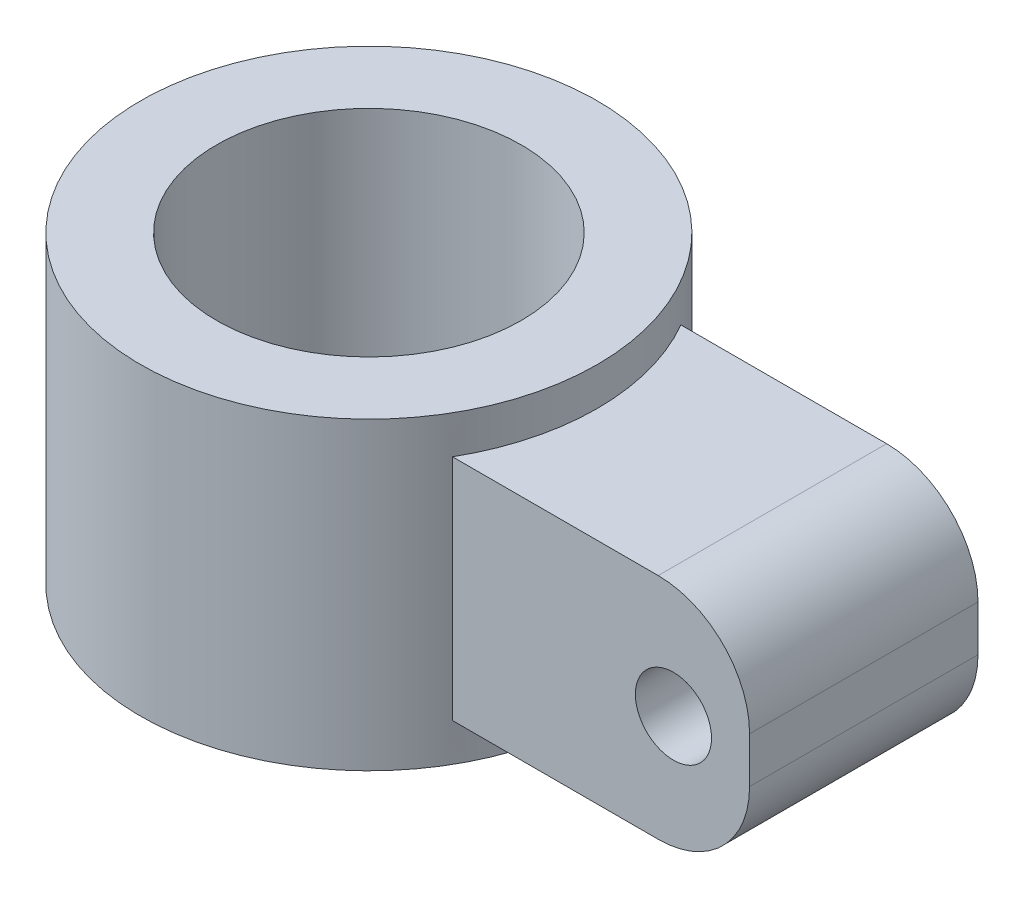
ISO-10303-21;
HEADER;
FILE_DESCRIPTION(('STEP AP214'),'2;1');
FILE_NAME('part.step','',(''),(''),'','','');
FILE_SCHEMA(('AUTOMOTIVE_DESIGN { 1 0 10303 214 1 1 1 1 }'));
ENDSEC;
DATA;
#1=APPLICATION_CONTEXT('core data for automotive mechanical design processes');
#2=APPLICATION_PROTOCOL_DEFINITION('international standard','automotive_design',2000,#1);
#3=PRODUCT_CONTEXT('',#1,'mechanical');
#4=PRODUCT('Part','Part','',(#3));
#5=PRODUCT_RELATED_PRODUCT_CATEGORY('part','',(#4));
#6=PRODUCT_DEFINITION_FORMATION('','',#4);
#7=PRODUCT_DEFINITION_CONTEXT('part definition',#1,'design');
#8=PRODUCT_DEFINITION('design','',#6,#7);
#9=PRODUCT_DEFINITION_SHAPE('','',#8);
#10=(LENGTH_UNIT() NAMED_UNIT(*) SI_UNIT(.MILLI.,.METRE.));
#11=(NAMED_UNIT(*) PLANE_ANGLE_UNIT() SI_UNIT($,.RADIAN.));
#12=(NAMED_UNIT(*) SI_UNIT($,.STERADIAN.) SOLID_ANGLE_UNIT());
#13=UNCERTAINTY_MEASURE_WITH_UNIT(LENGTH_MEASURE(1.E-05),#10,'distance_accuracy_value','');
#14=(GEOMETRIC_REPRESENTATION_CONTEXT(3) GLOBAL_UNCERTAINTY_ASSIGNED_CONTEXT((#13)) GLOBAL_UNIT_ASSIGNED_CONTEXT((#10,
#11,#12)) REPRESENTATION_CONTEXT('',''));
#15=CARTESIAN_POINT('',(0.,0.,0.));
#16=DIRECTION('',(0.,0.,1.));
#17=DIRECTION('',(1.,0.,0.));
#18=AXIS2_PLACEMENT_3D('',#15,#16,#17);
#19=CARTESIAN_POINT('',(0.,-10.,0.));
#20=DIRECTION('',(0.,1.,0.));
#21=DIRECTION('',(-1.,0.,0.));
#22=AXIS2_PLACEMENT_3D('',#19,#20,#21);
#23=CYLINDRICAL_SURFACE('',#22,7.5);
#24=CARTESIAN_POINT('',(0.,0.,0.));
#25=DIRECTION('',(0.,-1.,0.));
#26=DIRECTION('',(1.,0.,0.));
#27=AXIS2_PLACEMENT_3D('',#24,#25,#26);
#28=CIRCLE('',#27,7.5);
#29=CARTESIAN_POINT('',(7.5,0.,0.));
#30=VERTEX_POINT('',#29);
#31=EDGE_CURVE('E11',#30,#30,#28,.T.);
#32=ORIENTED_EDGE('',*,*,#31,.T.);
#33=EDGE_LOOP('',(#32));
#34=FACE_BOUND('',#33,.T.);
#35=CARTESIAN_POINT('',(0.,-10.,0.));
#36=DIRECTION('',(0.,-1.,0.));
#37=DIRECTION('',(1.,0.,0.));
#38=AXIS2_PLACEMENT_3D('',#35,#36,#37);
#39=CIRCLE('',#38,7.5);
#40=CARTESIAN_POINT('',(7.5,-10.,0.));
#41=VERTEX_POINT('',#40);
#42=EDGE_CURVE('E25',#41,#41,#39,.T.);
#43=ORIENTED_EDGE('',*,*,#42,.F.);
#44=EDGE_LOOP('',(#43));
#45=FACE_BOUND('',#44,.T.);
#46=CARTESIAN_POINT('',(0.,-1.25,0.));
#47=DIRECTION('',(0.,-1.,0.));
#48=DIRECTION('',(1.,0.,0.));
#49=AXIS2_PLACEMENT_3D('',#46,#47,#48);
#50=CIRCLE('',#49,7.5);
#51=CARTESIAN_POINT('',(6.49519052838329,-1.25,-3.75));
#52=VERTEX_POINT('',#51);
#53=CARTESIAN_POINT('',(6.49519052838329,-1.25,3.75));
#54=VERTEX_POINT('',#53);
#55=EDGE_CURVE('E36',#52,#54,#50,.T.);
#56=ORIENTED_EDGE('',*,*,#55,.F.);
#57=DIRECTION('',(0.,1.,0.));
#58=VECTOR('',#57,1.);
#59=CARTESIAN_POINT('',(6.49519052838329,-10.,-3.75));
#60=LINE('',#59,#58);
#61=CARTESIAN_POINT('',(6.49519052838329,-8.75,-3.75));
#62=VERTEX_POINT('',#61);
#63=EDGE_CURVE('E42',#62,#52,#60,.T.);
#64=ORIENTED_EDGE('',*,*,#63,.F.);
#65=CARTESIAN_POINT('',(0.,-8.75,0.));
#66=DIRECTION('',(0.,1.,0.));
#67=DIRECTION('',(-1.,0.,0.));
#68=AXIS2_PLACEMENT_3D('',#65,#66,#67);
#69=CIRCLE('',#68,7.5);
#70=CARTESIAN_POINT('',(6.49519052838329,-8.75,3.75));
#71=VERTEX_POINT('',#70);
#72=EDGE_CURVE('E167',#71,#62,#69,.T.);
#73=ORIENTED_EDGE('',*,*,#72,.F.);
#74=DIRECTION('',(0.,1.,0.));
#75=VECTOR('',#74,1.);
#76=CARTESIAN_POINT('',(6.49519052838329,-10.,3.75));
#77=LINE('',#76,#75);
#78=EDGE_CURVE('E163',#54,#71,#77,.F.);
#79=ORIENTED_EDGE('',*,*,#78,.F.);
#80=EDGE_LOOP('',(#56,#64,#73,#79));
#81=FACE_BOUND('',#80,.T.);
#82=ADVANCED_FACE('F17',(#34,#45,#81),#23,.T.);
#83=CARTESIAN_POINT('',(0.,-10.,0.));
#84=DIRECTION('',(0.,-1.,0.));
#85=DIRECTION('',(1.,0.,0.));
#86=AXIS2_PLACEMENT_3D('',#83,#84,#85);
#87=PLANE('',#86);
#88=ORIENTED_EDGE('',*,*,#42,.T.);
#89=EDGE_LOOP('',(#88));
#90=FACE_BOUND('',#89,.T.);
#91=CARTESIAN_POINT('',(0.,-10.,0.));
#92=DIRECTION('',(0.,-1.,0.));
#93=DIRECTION('',(1.,0.,0.));
#94=AXIS2_PLACEMENT_3D('',#91,#92,#93);
#95=CIRCLE('',#94,5.);
#96=CARTESIAN_POINT('',(5.,-10.,0.));
#97=VERTEX_POINT('',#96);
#98=EDGE_CURVE('E159',#97,#97,#95,.T.);
#99=ORIENTED_EDGE('',*,*,#98,.F.);
#100=EDGE_LOOP('',(#99));
#101=FACE_BOUND('',#100,.T.);
#102=ADVANCED_FACE('F179',(#90,#101),#87,.T.);
#103=CARTESIAN_POINT('',(0.,0.,0.));
#104=DIRECTION('',(0.,-1.,0.));
#105=DIRECTION('',(1.,0.,0.));
#106=AXIS2_PLACEMENT_3D('',#103,#104,#105);
#107=PLANE('',#106);
#108=ORIENTED_EDGE('',*,*,#31,.F.);
#109=EDGE_LOOP('',(#108));
#110=FACE_BOUND('',#109,.T.);
#111=CARTESIAN_POINT('',(0.,0.,0.));
#112=DIRECTION('',(0.,-1.,0.));
#113=DIRECTION('',(1.,0.,0.));
#114=AXIS2_PLACEMENT_3D('',#111,#112,#113);
#115=CIRCLE('',#114,5.);
#116=CARTESIAN_POINT('',(5.,0.,0.));
#117=VERTEX_POINT('',#116);
#118=EDGE_CURVE('E155',#117,#117,#115,.T.);
#119=ORIENTED_EDGE('',*,*,#118,.T.);
#120=EDGE_LOOP('',(#119));
#121=FACE_BOUND('',#120,.T.);
#122=ADVANCED_FACE('F188',(#110,#121),#107,.F.);
#123=CARTESIAN_POINT('',(0.,-10.,0.));
#124=DIRECTION('',(0.,1.,0.));
#125=DIRECTION('',(-1.,0.,0.));
#126=AXIS2_PLACEMENT_3D('',#123,#124,#125);
#127=CYLINDRICAL_SURFACE('',#126,5.);
#128=ORIENTED_EDGE('',*,*,#98,.T.);
#129=EDGE_LOOP('',(#128));
#130=FACE_BOUND('',#129,.T.);
#131=ORIENTED_EDGE('',*,*,#118,.F.);
#132=EDGE_LOOP('',(#131));
#133=FACE_BOUND('',#132,.T.);
#134=ADVANCED_FACE('F193',(#130,#133),#127,.F.);
#135=CARTESIAN_POINT('',(16.25,-8.75,3.75));
#136=DIRECTION('',(0.,0.,-1.));
#137=DIRECTION('',(0.,1.,0.));
#138=AXIS2_PLACEMENT_3D('',#135,#136,#137);
#139=PLANE('',#138);
#140=CARTESIAN_POINT('',(13.75,-5.,3.75));
#141=DIRECTION('',(0.,0.,-1.));
#142=DIRECTION('',(0.,1.,0.));
#143=AXIS2_PLACEMENT_3D('',#140,#141,#142);
#144=CIRCLE('',#143,1.25);
#145=CARTESIAN_POINT('',(13.75,-3.75,3.75));
#146=VERTEX_POINT('',#145);
#147=EDGE_CURVE('E151',#146,#146,#144,.T.);
#148=ORIENTED_EDGE('',*,*,#147,.T.);
#149=EDGE_LOOP('',(#148));
#150=FACE_BOUND('',#149,.T.);
#151=DIRECTION('',(-1.,0.,0.));
#152=VECTOR('',#151,1.);
#153=CARTESIAN_POINT('',(16.25,-8.75,3.75));
#154=LINE('',#153,#152);
#155=CARTESIAN_POINT('',(13.25,-8.75,3.75));
#156=VERTEX_POINT('',#155);
#157=EDGE_CURVE('E147',#156,#71,#154,.T.);
#158=ORIENTED_EDGE('',*,*,#157,.F.);
#159=CARTESIAN_POINT('',(13.25,-5.75,3.75));
#160=DIRECTION('',(0.,0.,-1.));
#161=DIRECTION('',(0.,1.,0.));
#162=AXIS2_PLACEMENT_3D('',#159,#160,#161);
#163=CIRCLE('',#162,3.);
#164=CARTESIAN_POINT('',(16.25,-5.75,3.75));
#165=VERTEX_POINT('',#164);
#166=EDGE_CURVE('E144',#156,#165,#163,.F.);
#167=ORIENTED_EDGE('',*,*,#166,.T.);
#168=DIRECTION('',(0.,-1.,0.));
#169=VECTOR('',#168,1.);
#170=CARTESIAN_POINT('',(16.25,-8.75,3.75));
#171=LINE('',#170,#169);
#172=CARTESIAN_POINT('',(16.25,-4.25,3.75));
#173=VERTEX_POINT('',#172);
#174=EDGE_CURVE('E141',#173,#165,#171,.T.);
#175=ORIENTED_EDGE('',*,*,#174,.F.);
#176=CARTESIAN_POINT('',(13.25,-4.25,3.75));
#177=DIRECTION('',(0.,0.,-1.));
#178=DIRECTION('',(0.,1.,0.));
#179=AXIS2_PLACEMENT_3D('',#176,#177,#178);
#180=CIRCLE('',#179,3.);
#181=CARTESIAN_POINT('',(13.25,-1.25,3.75));
#182=VERTEX_POINT('',#181);
#183=EDGE_CURVE('E111',#173,#182,#180,.F.);
#184=ORIENTED_EDGE('',*,*,#183,.T.);
#185=DIRECTION('',(-1.,0.,0.));
#186=VECTOR('',#185,1.);
#187=CARTESIAN_POINT('',(16.25,-1.25,3.75));
#188=LINE('',#187,#186);
#189=EDGE_CURVE('E135',#182,#54,#188,.T.);
#190=ORIENTED_EDGE('',*,*,#189,.T.);
#191=ORIENTED_EDGE('',*,*,#78,.T.);
#192=EDGE_LOOP('',(#158,#167,#175,#184,#190,#191));
#193=FACE_BOUND('',#192,.T.);
#194=ADVANCED_FACE('F198',(#150,#193),#139,.F.);
#195=CARTESIAN_POINT('',(16.25,-8.75,-3.75));
#196=DIRECTION('',(0.,0.,1.));
#197=DIRECTION('',(0.,-1.,0.));
#198=AXIS2_PLACEMENT_3D('',#195,#196,#197);
#199=PLANE('',#198);
#200=CARTESIAN_POINT('',(13.75,-5.,-3.75));
#201=DIRECTION('',(0.,0.,1.));
#202=DIRECTION('',(0.,-1.,0.));
#203=AXIS2_PLACEMENT_3D('',#200,#201,#202);
#204=CIRCLE('',#203,1.25);
#205=CARTESIAN_POINT('',(13.75,-6.25,-3.75));
#206=VERTEX_POINT('',#205);
#207=EDGE_CURVE('E107',#206,#206,#204,.T.);
#208=ORIENTED_EDGE('',*,*,#207,.T.);
#209=EDGE_LOOP('',(#208));
#210=FACE_BOUND('',#209,.T.);
#211=DIRECTION('',(0.,1.,0.));
#212=VECTOR('',#211,1.);
#213=CARTESIAN_POINT('',(16.25,-8.75,-3.75));
#214=LINE('',#213,#212);
#215=CARTESIAN_POINT('',(16.25,-5.75,-3.75));
#216=VERTEX_POINT('',#215);
#217=CARTESIAN_POINT('',(16.25,-4.25,-3.75));
#218=VERTEX_POINT('',#217);
#219=EDGE_CURVE('E86',#216,#218,#214,.T.);
#220=ORIENTED_EDGE('',*,*,#219,.F.);
#221=CARTESIAN_POINT('',(13.25,-5.75,-3.75));
#222=DIRECTION('',(0.,0.,1.));
#223=DIRECTION('',(0.,-1.,0.));
#224=AXIS2_PLACEMENT_3D('',#221,#222,#223);
#225=CIRCLE('',#224,3.);
#226=CARTESIAN_POINT('',(13.25,-8.75,-3.75));
#227=VERTEX_POINT('',#226);
#228=EDGE_CURVE('E108',#216,#227,#225,.F.);
#229=ORIENTED_EDGE('',*,*,#228,.T.);
#230=DIRECTION('',(-1.,0.,0.));
#231=VECTOR('',#230,1.);
#232=CARTESIAN_POINT('',(16.25,-8.75,-3.75));
#233=LINE('',#232,#231);
#234=EDGE_CURVE('E127',#227,#62,#233,.T.);
#235=ORIENTED_EDGE('',*,*,#234,.T.);
#236=ORIENTED_EDGE('',*,*,#63,.T.);
#237=DIRECTION('',(-1.,0.,0.));
#238=VECTOR('',#237,1.);
#239=CARTESIAN_POINT('',(16.25,-1.25,-3.75));
#240=LINE('',#239,#238);
#241=CARTESIAN_POINT('',(13.25,-1.25,-3.75));
#242=VERTEX_POINT('',#241);
#243=EDGE_CURVE('E89',#242,#52,#240,.T.);
#244=ORIENTED_EDGE('',*,*,#243,.F.);
#245=CARTESIAN_POINT('',(13.25,-4.25,-3.75));
#246=DIRECTION('',(0.,0.,1.));
#247=DIRECTION('',(0.,-1.,0.));
#248=AXIS2_PLACEMENT_3D('',#245,#246,#247);
#249=CIRCLE('',#248,3.);
#250=EDGE_CURVE('E83',#242,#218,#249,.F.);
#251=ORIENTED_EDGE('',*,*,#250,.T.);
#252=EDGE_LOOP('',(#220,#229,#235,#236,#244,#251));
#253=FACE_BOUND('',#252,.T.);
#254=ADVANCED_FACE('F85',(#210,#253),#199,.F.);
#255=CARTESIAN_POINT('',(16.25,-1.25,3.75));
#256=DIRECTION('',(0.,-1.,0.));
#257=DIRECTION('',(1.,0.,0.));
#258=AXIS2_PLACEMENT_3D('',#255,#256,#257);
#259=PLANE('',#258);
#260=ORIENTED_EDGE('',*,*,#189,.F.);
#261=DIRECTION('',(0.,0.,1.));
#262=VECTOR('',#261,1.);
#263=CARTESIAN_POINT('',(13.25,-1.25,-3.75));
#264=LINE('',#263,#262);
#265=EDGE_CURVE('E95',#182,#242,#264,.F.);
#266=ORIENTED_EDGE('',*,*,#265,.T.);
#267=ORIENTED_EDGE('',*,*,#243,.T.);
#268=ORIENTED_EDGE('',*,*,#55,.T.);
#269=EDGE_LOOP('',(#260,#266,#267,#268));
#270=FACE_BOUND('',#269,.T.);
#271=ADVANCED_FACE('F209',(#270),#259,.F.);
#272=CARTESIAN_POINT('',(16.25,-8.75,3.75));
#273=DIRECTION('',(0.,1.,0.));
#274=DIRECTION('',(-1.,0.,0.));
#275=AXIS2_PLACEMENT_3D('',#272,#273,#274);
#276=PLANE('',#275);
#277=ORIENTED_EDGE('',*,*,#234,.F.);
#278=DIRECTION('',(0.,0.,-1.));
#279=VECTOR('',#278,1.);
#280=CARTESIAN_POINT('',(13.25,-8.75,3.75));
#281=LINE('',#280,#279);
#282=EDGE_CURVE('E117',#227,#156,#281,.F.);
#283=ORIENTED_EDGE('',*,*,#282,.T.);
#284=ORIENTED_EDGE('',*,*,#157,.T.);
#285=ORIENTED_EDGE('',*,*,#72,.T.);
#286=EDGE_LOOP('',(#277,#283,#284,#285));
#287=FACE_BOUND('',#286,.T.);
#288=ADVANCED_FACE('F213',(#287),#276,.F.);
#289=CARTESIAN_POINT('',(16.25,0.,0.));
#290=DIRECTION('',(1.,0.,0.));
#291=DIRECTION('',(0.,1.,0.));
#292=AXIS2_PLACEMENT_3D('',#289,#290,#291);
#293=PLANE('',#292);
#294=ORIENTED_EDGE('',*,*,#174,.T.);
#295=DIRECTION('',(0.,0.,-1.));
#296=VECTOR('',#295,1.);
#297=CARTESIAN_POINT('',(16.25,-5.75,-3.75));
#298=LINE('',#297,#296);
#299=EDGE_CURVE('E104',#165,#216,#298,.T.);
#300=ORIENTED_EDGE('',*,*,#299,.T.);
#301=ORIENTED_EDGE('',*,*,#219,.T.);
#302=DIRECTION('',(0.,0.,1.));
#303=VECTOR('',#302,1.);
#304=CARTESIAN_POINT('',(16.25,-4.25,3.75));
#305=LINE('',#304,#303);
#306=EDGE_CURVE('E101',#218,#173,#305,.T.);
#307=ORIENTED_EDGE('',*,*,#306,.T.);
#308=EDGE_LOOP('',(#294,#300,#301,#307));
#309=FACE_BOUND('',#308,.T.);
#310=ADVANCED_FACE('F100',(#309),#293,.T.);
#311=CARTESIAN_POINT('',(13.75,-5.,-7.5));
#312=DIRECTION('',(0.,0.,1.));
#313=DIRECTION('',(0.,-1.,0.));
#314=AXIS2_PLACEMENT_3D('',#311,#312,#313);
#315=CYLINDRICAL_SURFACE('',#314,1.25);
#316=ORIENTED_EDGE('',*,*,#207,.F.);
#317=EDGE_LOOP('',(#316));
#318=FACE_BOUND('',#317,.T.);
#319=ORIENTED_EDGE('',*,*,#147,.F.);
#320=EDGE_LOOP('',(#319));
#321=FACE_BOUND('',#320,.T.);
#322=ADVANCED_FACE('F220',(#318,#321),#315,.F.);
#323=CARTESIAN_POINT('',(13.25,-5.75,0.));
#324=DIRECTION('',(0.,0.,1.));
#325=DIRECTION('',(0.,-1.,0.));
#326=AXIS2_PLACEMENT_3D('',#323,#324,#325);
#327=CYLINDRICAL_SURFACE('',#326,3.);
#328=ORIENTED_EDGE('',*,*,#166,.F.);
#329=ORIENTED_EDGE('',*,*,#282,.F.);
#330=ORIENTED_EDGE('',*,*,#228,.F.);
#331=ORIENTED_EDGE('',*,*,#299,.F.);
#332=EDGE_LOOP('',(#328,#329,#330,#331));
#333=FACE_BOUND('',#332,.T.);
#334=ADVANCED_FACE('F223',(#333),#327,.T.);
#335=CARTESIAN_POINT('',(13.25,-4.25,0.));
#336=DIRECTION('',(0.,0.,-1.));
#337=DIRECTION('',(0.,1.,0.));
#338=AXIS2_PLACEMENT_3D('',#335,#336,#337);
#339=CYLINDRICAL_SURFACE('',#338,3.);
#340=ORIENTED_EDGE('',*,*,#250,.F.);
#341=ORIENTED_EDGE('',*,*,#265,.F.);
#342=ORIENTED_EDGE('',*,*,#183,.F.);
#343=ORIENTED_EDGE('',*,*,#306,.F.);
#344=EDGE_LOOP('',(#340,#341,#342,#343));
#345=FACE_BOUND('',#344,.T.);
#346=ADVANCED_FACE('F110',(#345),#339,.T.);
#347=CLOSED_SHELL('',(#82,#102,#122,#134,#194,#254,#271,#288,#310,#322,#334,#346));
#348=MANIFOLD_SOLID_BREP('B1',#347);
#349=ADVANCED_BREP_SHAPE_REPRESENTATION('',(#18,#348),#14);
#350=SHAPE_DEFINITION_REPRESENTATION(#9,#349);
ENDSEC;
END-ISO-10303-21;
